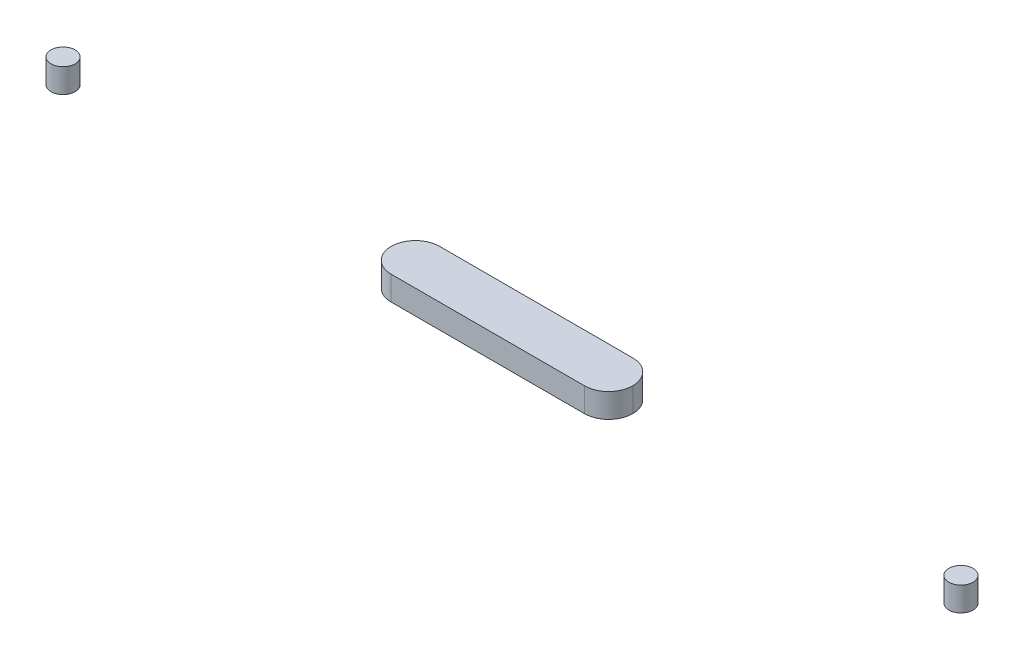
ISO-10303-21;
HEADER;
FILE_DESCRIPTION(('STEP AP214'),'2;1');
FILE_NAME('part.step','',(''),(''),'','','');
FILE_SCHEMA(('AUTOMOTIVE_DESIGN { 1 0 10303 214 1 1 1 1 }'));
ENDSEC;
DATA;
#1=APPLICATION_CONTEXT('core data for automotive mechanical design processes');
#2=APPLICATION_PROTOCOL_DEFINITION('international standard','automotive_design',2000,#1);
#3=PRODUCT_CONTEXT('',#1,'mechanical');
#4=PRODUCT('Part','Part','',(#3));
#5=PRODUCT_RELATED_PRODUCT_CATEGORY('part','',(#4));
#6=PRODUCT_DEFINITION_FORMATION('','',#4);
#7=PRODUCT_DEFINITION_CONTEXT('part definition',#1,'design');
#8=PRODUCT_DEFINITION('design','',#6,#7);
#9=PRODUCT_DEFINITION_SHAPE('','',#8);
#10=(LENGTH_UNIT() NAMED_UNIT(*) SI_UNIT(.MILLI.,.METRE.));
#11=(NAMED_UNIT(*) PLANE_ANGLE_UNIT() SI_UNIT($,.RADIAN.));
#12=(NAMED_UNIT(*) SI_UNIT($,.STERADIAN.) SOLID_ANGLE_UNIT());
#13=UNCERTAINTY_MEASURE_WITH_UNIT(LENGTH_MEASURE(1.E-05),#10,'distance_accuracy_value','');
#14=(GEOMETRIC_REPRESENTATION_CONTEXT(3) GLOBAL_UNCERTAINTY_ASSIGNED_CONTEXT((#13)) GLOBAL_UNIT_ASSIGNED_CONTEXT((#10,
#11,#12)) REPRESENTATION_CONTEXT('',''));
#15=CARTESIAN_POINT('',(0.,0.,0.));
#16=DIRECTION('',(0.,0.,1.));
#17=DIRECTION('',(1.,0.,0.));
#18=AXIS2_PLACEMENT_3D('',#15,#16,#17);
#19=CARTESIAN_POINT('',(92.9315529420762,5.,0.));
#20=DIRECTION('',(0.,-1.,0.));
#21=DIRECTION('',(0.,0.,-1.));
#22=AXIS2_PLACEMENT_3D('',#19,#20,#21);
#23=CYLINDRICAL_SURFACE('',#22,2.5);
#24=CARTESIAN_POINT('',(92.9315529420762,5.,0.));
#25=DIRECTION('',(0.,1.,0.));
#26=DIRECTION('',(0.,0.,-1.));
#27=AXIS2_PLACEMENT_3D('',#24,#25,#26);
#28=CIRCLE('',#27,2.5);
#29=CARTESIAN_POINT('',(92.9315529420762,5.,-2.50000000000002));
#30=VERTEX_POINT('',#29);
#31=EDGE_CURVE('E11',#30,#30,#28,.T.);
#32=ORIENTED_EDGE('',*,*,#31,.F.);
#33=EDGE_LOOP('',(#32));
#34=FACE_BOUND('',#33,.T.);
#35=CARTESIAN_POINT('',(92.9315529420762,0.,0.));
#36=DIRECTION('',(0.,1.,0.));
#37=DIRECTION('',(0.,0.,-1.));
#38=AXIS2_PLACEMENT_3D('',#35,#36,#37);
#39=CIRCLE('',#38,2.5);
#40=CARTESIAN_POINT('',(92.9315529420762,0.,-2.50000000000002));
#41=VERTEX_POINT('',#40);
#42=EDGE_CURVE('E43',#41,#41,#39,.T.);
#43=ORIENTED_EDGE('',*,*,#42,.T.);
#44=EDGE_LOOP('',(#43));
#45=FACE_BOUND('',#44,.T.);
#46=ADVANCED_FACE('F40',(#34,#45),#23,.T.);
#47=CARTESIAN_POINT('',(92.9315529420762,5.,0.));
#48=DIRECTION('',(0.,-1.,0.));
#49=DIRECTION('',(0.,0.,-1.));
#50=AXIS2_PLACEMENT_3D('',#47,#48,#49);
#51=PLANE('',#50);
#52=ORIENTED_EDGE('',*,*,#31,.T.);
#53=EDGE_LOOP('',(#52));
#54=FACE_BOUND('',#53,.T.);
#55=ADVANCED_FACE('F55',(#54),#51,.F.);
#56=CARTESIAN_POINT('',(92.9315529420762,0.,0.));
#57=DIRECTION('',(0.,-1.,0.));
#58=DIRECTION('',(0.,0.,-1.));
#59=AXIS2_PLACEMENT_3D('',#56,#57,#58);
#60=PLANE('',#59);
#61=ORIENTED_EDGE('',*,*,#42,.F.);
#62=EDGE_LOOP('',(#61));
#63=FACE_BOUND('',#62,.T.);
#64=ADVANCED_FACE('F53',(#63),#60,.T.);
#65=CLOSED_SHELL('',(#46,#55,#64));
#66=MANIFOLD_SOLID_BREP('B2',#65);
#67=CARTESIAN_POINT('',(-92.9315529420762,5.,0.));
#68=DIRECTION('',(0.,-1.,0.));
#69=DIRECTION('',(0.,0.,-1.));
#70=AXIS2_PLACEMENT_3D('',#67,#68,#69);
#71=CYLINDRICAL_SURFACE('',#70,2.5);
#72=CARTESIAN_POINT('',(-92.9315529420762,5.,0.));
#73=DIRECTION('',(0.,1.,0.));
#74=DIRECTION('',(0.,0.,1.));
#75=AXIS2_PLACEMENT_3D('',#72,#73,#74);
#76=CIRCLE('',#75,2.5);
#77=CARTESIAN_POINT('',(-92.9315529420762,5.,2.5));
#78=VERTEX_POINT('',#77);
#79=EDGE_CURVE('E39',#78,#78,#76,.T.);
#80=ORIENTED_EDGE('',*,*,#79,.F.);
#81=EDGE_LOOP('',(#80));
#82=FACE_BOUND('',#81,.T.);
#83=CARTESIAN_POINT('',(-92.9315529420762,0.,0.));
#84=DIRECTION('',(0.,1.,0.));
#85=DIRECTION('',(0.,0.,1.));
#86=AXIS2_PLACEMENT_3D('',#83,#84,#85);
#87=CIRCLE('',#86,2.5);
#88=CARTESIAN_POINT('',(-92.9315529420762,0.,2.5));
#89=VERTEX_POINT('',#88);
#90=EDGE_CURVE('E93',#89,#89,#87,.T.);
#91=ORIENTED_EDGE('',*,*,#90,.T.);
#92=EDGE_LOOP('',(#91));
#93=FACE_BOUND('',#92,.T.);
#94=ADVANCED_FACE('F90',(#82,#93),#71,.T.);
#95=CARTESIAN_POINT('',(-92.9315529420762,5.,0.));
#96=DIRECTION('',(0.,1.,0.));
#97=DIRECTION('',(0.,0.,1.));
#98=AXIS2_PLACEMENT_3D('',#95,#96,#97);
#99=PLANE('',#98);
#100=ORIENTED_EDGE('',*,*,#79,.T.);
#101=EDGE_LOOP('',(#100));
#102=FACE_BOUND('',#101,.T.);
#103=ADVANCED_FACE('F105',(#102),#99,.T.);
#104=CARTESIAN_POINT('',(-92.9315529420762,0.,0.));
#105=DIRECTION('',(0.,1.,0.));
#106=DIRECTION('',(0.,0.,1.));
#107=AXIS2_PLACEMENT_3D('',#104,#105,#106);
#108=PLANE('',#107);
#109=ORIENTED_EDGE('',*,*,#90,.F.);
#110=EDGE_LOOP('',(#109));
#111=FACE_BOUND('',#110,.T.);
#112=ADVANCED_FACE('F103',(#111),#108,.F.);
#113=CLOSED_SHELL('',(#94,#103,#112));
#114=MANIFOLD_SOLID_BREP('B6',#113);
#115=CARTESIAN_POINT('',(25.,5.,5.));
#116=DIRECTION('',(0.,0.,-1.));
#117=DIRECTION('',(-1.,0.,0.));
#118=AXIS2_PLACEMENT_3D('',#115,#116,#117);
#119=PLANE('',#118);
#120=DIRECTION('',(1.,0.,0.));
#121=VECTOR('',#120,1.);
#122=CARTESIAN_POINT('',(25.,0.,5.));
#123=LINE('',#122,#121);
#124=CARTESIAN_POINT('',(-20.,0.,5.));
#125=VERTEX_POINT('',#124);
#126=CARTESIAN_POINT('',(20.,0.,5.));
#127=VERTEX_POINT('',#126);
#128=EDGE_CURVE('E193',#125,#127,#123,.T.);
#129=ORIENTED_EDGE('',*,*,#128,.T.);
#130=DIRECTION('',(0.,-1.,0.));
#131=VECTOR('',#130,1.);
#132=CARTESIAN_POINT('',(20.,5.,5.));
#133=LINE('',#132,#131);
#134=CARTESIAN_POINT('',(20.,5.,5.));
#135=VERTEX_POINT('',#134);
#136=EDGE_CURVE('E88',#127,#135,#133,.F.);
#137=ORIENTED_EDGE('',*,*,#136,.T.);
#138=DIRECTION('',(1.,0.,0.));
#139=VECTOR('',#138,1.);
#140=CARTESIAN_POINT('',(25.,5.,5.));
#141=LINE('',#140,#139);
#142=CARTESIAN_POINT('',(-20.,5.,5.));
#143=VERTEX_POINT('',#142);
#144=EDGE_CURVE('E225',#143,#135,#141,.T.);
#145=ORIENTED_EDGE('',*,*,#144,.F.);
#146=DIRECTION('',(0.,-1.,0.));
#147=VECTOR('',#146,1.);
#148=CARTESIAN_POINT('',(-20.,5.,5.));
#149=LINE('',#148,#147);
#150=EDGE_CURVE('E140',#143,#125,#149,.T.);
#151=ORIENTED_EDGE('',*,*,#150,.T.);
#152=EDGE_LOOP('',(#129,#137,#145,#151));
#153=FACE_BOUND('',#152,.T.);
#154=ADVANCED_FACE('F131',(#153),#119,.F.);
#155=CARTESIAN_POINT('',(25.,5.,-5.));
#156=DIRECTION('',(0.,0.,1.));
#157=DIRECTION('',(1.,0.,0.));
#158=AXIS2_PLACEMENT_3D('',#155,#156,#157);
#159=PLANE('',#158);
#160=DIRECTION('',(-1.,0.,0.));
#161=VECTOR('',#160,1.);
#162=CARTESIAN_POINT('',(25.,0.,-5.));
#163=LINE('',#162,#161);
#164=CARTESIAN_POINT('',(20.,0.,-5.));
#165=VERTEX_POINT('',#164);
#166=CARTESIAN_POINT('',(-20.,0.,-5.));
#167=VERTEX_POINT('',#166);
#168=EDGE_CURVE('E226',#165,#167,#163,.T.);
#169=ORIENTED_EDGE('',*,*,#168,.T.);
#170=DIRECTION('',(0.,-1.,0.));
#171=VECTOR('',#170,1.);
#172=CARTESIAN_POINT('',(-20.,5.,-5.));
#173=LINE('',#172,#171);
#174=CARTESIAN_POINT('',(-20.,5.,-5.));
#175=VERTEX_POINT('',#174);
#176=EDGE_CURVE('E207',#167,#175,#173,.F.);
#177=ORIENTED_EDGE('',*,*,#176,.T.);
#178=DIRECTION('',(-1.,0.,0.));
#179=VECTOR('',#178,1.);
#180=CARTESIAN_POINT('',(25.,5.,-5.));
#181=LINE('',#180,#179);
#182=CARTESIAN_POINT('',(20.,5.,-5.));
#183=VERTEX_POINT('',#182);
#184=EDGE_CURVE('E196',#183,#175,#181,.T.);
#185=ORIENTED_EDGE('',*,*,#184,.F.);
#186=DIRECTION('',(0.,-1.,0.));
#187=VECTOR('',#186,1.);
#188=CARTESIAN_POINT('',(20.,5.,-5.));
#189=LINE('',#188,#187);
#190=EDGE_CURVE('E215',#183,#165,#189,.T.);
#191=ORIENTED_EDGE('',*,*,#190,.T.);
#192=EDGE_LOOP('',(#169,#177,#185,#191));
#193=FACE_BOUND('',#192,.T.);
#194=ADVANCED_FACE('F232',(#193),#159,.F.);
#195=CARTESIAN_POINT('',(0.,5.,0.));
#196=DIRECTION('',(0.,1.,0.));
#197=DIRECTION('',(0.,0.,1.));
#198=AXIS2_PLACEMENT_3D('',#195,#196,#197);
#199=PLANE('',#198);
#200=CARTESIAN_POINT('',(20.,5.,0.));
#201=DIRECTION('',(0.,1.,0.));
#202=DIRECTION('',(0.,0.,1.));
#203=AXIS2_PLACEMENT_3D('',#200,#201,#202);
#204=CIRCLE('',#203,5.);
#205=CARTESIAN_POINT('',(25.,5.,0.));
#206=VERTEX_POINT('',#205);
#207=EDGE_CURVE('E148',#135,#206,#204,.T.);
#208=ORIENTED_EDGE('',*,*,#207,.T.);
#209=CARTESIAN_POINT('',(20.,5.,0.));
#210=DIRECTION('',(0.,1.,0.));
#211=DIRECTION('',(0.,0.,1.));
#212=AXIS2_PLACEMENT_3D('',#209,#210,#211);
#213=CIRCLE('',#212,5.);
#214=EDGE_CURVE('E223',#206,#183,#213,.T.);
#215=ORIENTED_EDGE('',*,*,#214,.T.);
#216=ORIENTED_EDGE('',*,*,#184,.T.);
#217=CARTESIAN_POINT('',(-20.,5.,0.));
#218=DIRECTION('',(0.,1.,0.));
#219=DIRECTION('',(0.,0.,1.));
#220=AXIS2_PLACEMENT_3D('',#217,#218,#219);
#221=CIRCLE('',#220,5.);
#222=CARTESIAN_POINT('',(-25.,5.,0.));
#223=VERTEX_POINT('',#222);
#224=EDGE_CURVE('E220',#175,#223,#221,.T.);
#225=ORIENTED_EDGE('',*,*,#224,.T.);
#226=CARTESIAN_POINT('',(-20.,5.,0.));
#227=DIRECTION('',(0.,1.,0.));
#228=DIRECTION('',(0.,0.,1.));
#229=AXIS2_PLACEMENT_3D('',#226,#227,#228);
#230=CIRCLE('',#229,5.);
#231=EDGE_CURVE('E202',#223,#143,#230,.T.);
#232=ORIENTED_EDGE('',*,*,#231,.T.);
#233=ORIENTED_EDGE('',*,*,#144,.T.);
#234=EDGE_LOOP('',(#208,#215,#216,#225,#232,#233));
#235=FACE_BOUND('',#234,.T.);
#236=ADVANCED_FACE('F241',(#235),#199,.T.);
#237=CARTESIAN_POINT('',(0.,0.,0.));
#238=DIRECTION('',(0.,1.,0.));
#239=DIRECTION('',(0.,0.,1.));
#240=AXIS2_PLACEMENT_3D('',#237,#238,#239);
#241=PLANE('',#240);
#242=ORIENTED_EDGE('',*,*,#168,.F.);
#243=CARTESIAN_POINT('',(20.,0.,0.));
#244=DIRECTION('',(0.,1.,0.));
#245=DIRECTION('',(0.,0.,1.));
#246=AXIS2_PLACEMENT_3D('',#243,#244,#245);
#247=CIRCLE('',#246,5.);
#248=CARTESIAN_POINT('',(25.,0.,0.));
#249=VERTEX_POINT('',#248);
#250=EDGE_CURVE('E210',#165,#249,#247,.F.);
#251=ORIENTED_EDGE('',*,*,#250,.T.);
#252=CARTESIAN_POINT('',(20.,0.,0.));
#253=DIRECTION('',(0.,1.,0.));
#254=DIRECTION('',(0.,0.,1.));
#255=AXIS2_PLACEMENT_3D('',#252,#253,#254);
#256=CIRCLE('',#255,5.);
#257=EDGE_CURVE('E208',#249,#127,#256,.F.);
#258=ORIENTED_EDGE('',*,*,#257,.T.);
#259=ORIENTED_EDGE('',*,*,#128,.F.);
#260=CARTESIAN_POINT('',(-20.,0.,0.));
#261=DIRECTION('',(0.,1.,0.));
#262=DIRECTION('',(0.,0.,1.));
#263=AXIS2_PLACEMENT_3D('',#260,#261,#262);
#264=CIRCLE('',#263,5.);
#265=CARTESIAN_POINT('',(-25.,0.,0.));
#266=VERTEX_POINT('',#265);
#267=EDGE_CURVE('E186',#125,#266,#264,.F.);
#268=ORIENTED_EDGE('',*,*,#267,.T.);
#269=CARTESIAN_POINT('',(-20.,0.,0.));
#270=DIRECTION('',(0.,1.,0.));
#271=DIRECTION('',(0.,0.,1.));
#272=AXIS2_PLACEMENT_3D('',#269,#270,#271);
#273=CIRCLE('',#272,5.);
#274=EDGE_CURVE('E191',#266,#167,#273,.F.);
#275=ORIENTED_EDGE('',*,*,#274,.T.);
#276=EDGE_LOOP('',(#242,#251,#258,#259,#268,#275));
#277=FACE_BOUND('',#276,.T.);
#278=ADVANCED_FACE('F189',(#277),#241,.F.);
#279=CARTESIAN_POINT('',(-20.,5.,0.));
#280=DIRECTION('',(0.,-1.,0.));
#281=DIRECTION('',(0.,0.,-1.));
#282=AXIS2_PLACEMENT_3D('',#279,#280,#281);
#283=CYLINDRICAL_SURFACE('',#282,5.);
#284=ORIENTED_EDGE('',*,*,#150,.F.);
#285=ORIENTED_EDGE('',*,*,#231,.F.);
#286=DIRECTION('',(0.,-1.,0.));
#287=VECTOR('',#286,1.);
#288=CARTESIAN_POINT('',(-25.,5.,0.));
#289=LINE('',#288,#287);
#290=EDGE_CURVE('E200',#266,#223,#289,.F.);
#291=ORIENTED_EDGE('',*,*,#290,.F.);
#292=ORIENTED_EDGE('',*,*,#267,.F.);
#293=EDGE_LOOP('',(#284,#285,#291,#292));
#294=FACE_BOUND('',#293,.T.);
#295=ADVANCED_FACE('F201',(#294),#283,.T.);
#296=CARTESIAN_POINT('',(-20.,5.,0.));
#297=DIRECTION('',(0.,-1.,0.));
#298=DIRECTION('',(0.,0.,-1.));
#299=AXIS2_PLACEMENT_3D('',#296,#297,#298);
#300=CYLINDRICAL_SURFACE('',#299,5.);
#301=ORIENTED_EDGE('',*,*,#224,.F.);
#302=ORIENTED_EDGE('',*,*,#176,.F.);
#303=ORIENTED_EDGE('',*,*,#274,.F.);
#304=ORIENTED_EDGE('',*,*,#290,.T.);
#305=EDGE_LOOP('',(#301,#302,#303,#304));
#306=FACE_BOUND('',#305,.T.);
#307=ADVANCED_FACE('F205',(#306),#300,.T.);
#308=CARTESIAN_POINT('',(20.,5.,0.));
#309=DIRECTION('',(0.,-1.,0.));
#310=DIRECTION('',(0.,0.,-1.));
#311=AXIS2_PLACEMENT_3D('',#308,#309,#310);
#312=CYLINDRICAL_SURFACE('',#311,5.);
#313=DIRECTION('',(0.,-1.,0.));
#314=VECTOR('',#313,1.);
#315=CARTESIAN_POINT('',(25.,5.,0.));
#316=LINE('',#315,#314);
#317=EDGE_CURVE('E135',#206,#249,#316,.T.);
#318=ORIENTED_EDGE('',*,*,#317,.F.);
#319=ORIENTED_EDGE('',*,*,#207,.F.);
#320=ORIENTED_EDGE('',*,*,#136,.F.);
#321=ORIENTED_EDGE('',*,*,#257,.F.);
#322=EDGE_LOOP('',(#318,#319,#320,#321));
#323=FACE_BOUND('',#322,.T.);
#324=ADVANCED_FACE('F133',(#323),#312,.T.);
#325=CARTESIAN_POINT('',(20.,5.,0.));
#326=DIRECTION('',(0.,-1.,0.));
#327=DIRECTION('',(0.,0.,-1.));
#328=AXIS2_PLACEMENT_3D('',#325,#326,#327);
#329=CYLINDRICAL_SURFACE('',#328,5.);
#330=ORIENTED_EDGE('',*,*,#214,.F.);
#331=ORIENTED_EDGE('',*,*,#317,.T.);
#332=ORIENTED_EDGE('',*,*,#250,.F.);
#333=ORIENTED_EDGE('',*,*,#190,.F.);
#334=EDGE_LOOP('',(#330,#331,#332,#333));
#335=FACE_BOUND('',#334,.T.);
#336=ADVANCED_FACE('F240',(#335),#329,.T.);
#337=CLOSED_SHELL('',(#154,#194,#236,#278,#295,#307,#324,#336));
#338=MANIFOLD_SOLID_BREP('B34',#337);
#339=ADVANCED_BREP_SHAPE_REPRESENTATION('',(#18,#66,#114,#338),#14);
#340=SHAPE_DEFINITION_REPRESENTATION(#9,#339);
ENDSEC;
END-ISO-10303-21;
